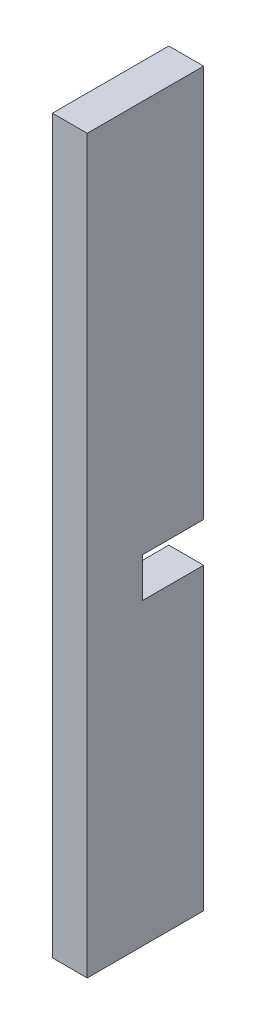
ISO-10303-21;
HEADER;
FILE_DESCRIPTION(('STEP AP214'),'2;1');
FILE_NAME('part.step','',(''),(''),'','','');
FILE_SCHEMA(('AUTOMOTIVE_DESIGN { 1 0 10303 214 1 1 1 1 }'));
ENDSEC;
DATA;
#1=APPLICATION_CONTEXT('core data for automotive mechanical design processes');
#2=APPLICATION_PROTOCOL_DEFINITION('international standard','automotive_design',2000,#1);
#3=PRODUCT_CONTEXT('',#1,'mechanical');
#4=PRODUCT('Part','Part','',(#3));
#5=PRODUCT_RELATED_PRODUCT_CATEGORY('part','',(#4));
#6=PRODUCT_DEFINITION_FORMATION('','',#4);
#7=PRODUCT_DEFINITION_CONTEXT('part definition',#1,'design');
#8=PRODUCT_DEFINITION('design','',#6,#7);
#9=PRODUCT_DEFINITION_SHAPE('','',#8);
#10=(LENGTH_UNIT() NAMED_UNIT(*) SI_UNIT(.MILLI.,.METRE.));
#11=(NAMED_UNIT(*) PLANE_ANGLE_UNIT() SI_UNIT($,.RADIAN.));
#12=(NAMED_UNIT(*) SI_UNIT($,.STERADIAN.) SOLID_ANGLE_UNIT());
#13=UNCERTAINTY_MEASURE_WITH_UNIT(LENGTH_MEASURE(1.E-05),#10,'distance_accuracy_value','');
#14=(GEOMETRIC_REPRESENTATION_CONTEXT(3) GLOBAL_UNCERTAINTY_ASSIGNED_CONTEXT((#13)) GLOBAL_UNIT_ASSIGNED_CONTEXT((#10,
#11,#12)) REPRESENTATION_CONTEXT('',''));
#15=CARTESIAN_POINT('',(0.,0.,0.));
#16=DIRECTION('',(0.,0.,1.));
#17=DIRECTION('',(1.,0.,0.));
#18=AXIS2_PLACEMENT_3D('',#15,#16,#17);
#19=CARTESIAN_POINT('',(0.,0.,0.));
#20=DIRECTION('',(0.,0.,-1.));
#21=DIRECTION('',(-1.,0.,0.));
#22=AXIS2_PLACEMENT_3D('',#19,#20,#21);
#23=PLANE('',#22);
#24=DIRECTION('',(1.,0.,0.));
#25=VECTOR('',#24,1.);
#26=CARTESIAN_POINT('',(0.,-17.0000000000002,0.));
#27=LINE('',#26,#25);
#28=CARTESIAN_POINT('',(-11.,-17.0000000000002,0.));
#29=VERTEX_POINT('',#28);
#30=CARTESIAN_POINT('',(11.,-17.0000000000002,0.));
#31=VERTEX_POINT('',#30);
#32=EDGE_CURVE('E11',#29,#31,#27,.T.);
#33=ORIENTED_EDGE('',*,*,#32,.F.);
#34=DIRECTION('',(0.,-1.,0.));
#35=VECTOR('',#34,1.);
#36=CARTESIAN_POINT('',(-11.,231.,0.));
#37=LINE('',#36,#35);
#38=CARTESIAN_POINT('',(-11.,231.,0.));
#39=VERTEX_POINT('',#38);
#40=EDGE_CURVE('E135',#39,#29,#37,.T.);
#41=ORIENTED_EDGE('',*,*,#40,.F.);
#42=DIRECTION('',(-1.,0.,0.));
#43=VECTOR('',#42,1.);
#44=CARTESIAN_POINT('',(11.,231.,0.));
#45=LINE('',#44,#43);
#46=CARTESIAN_POINT('',(11.,231.,0.));
#47=VERTEX_POINT('',#46);
#48=EDGE_CURVE('E136',#47,#39,#45,.T.);
#49=ORIENTED_EDGE('',*,*,#48,.F.);
#50=DIRECTION('',(0.,1.,0.));
#51=VECTOR('',#50,1.);
#52=CARTESIAN_POINT('',(11.,231.,0.));
#53=LINE('',#52,#51);
#54=EDGE_CURVE('E166',#31,#47,#53,.T.);
#55=ORIENTED_EDGE('',*,*,#54,.F.);
#56=EDGE_LOOP('',(#33,#41,#49,#55));
#57=FACE_BOUND('',#56,.T.);
#58=ADVANCED_FACE('F39',(#57),#23,.T.);
#59=CARTESIAN_POINT('',(11.,231.,73.5));
#60=DIRECTION('',(-1.,0.,0.));
#61=DIRECTION('',(0.,0.,1.));
#62=AXIS2_PLACEMENT_3D('',#59,#60,#61);
#63=PLANE('',#62);
#64=DIRECTION('',(0.,1.,0.));
#65=VECTOR('',#64,1.);
#66=CARTESIAN_POINT('',(11.,231.,38.5));
#67=LINE('',#66,#65);
#68=CARTESIAN_POINT('',(11.,-42.0000000000003,38.5));
#69=VERTEX_POINT('',#68);
#70=CARTESIAN_POINT('',(11.,-17.0000000000002,38.5));
#71=VERTEX_POINT('',#70);
#72=EDGE_CURVE('E171',#69,#71,#67,.T.);
#73=ORIENTED_EDGE('',*,*,#72,.T.);
#74=DIRECTION('',(0.,0.,-1.));
#75=VECTOR('',#74,1.);
#76=CARTESIAN_POINT('',(11.,-17.0000000000002,73.5));
#77=LINE('',#76,#75);
#78=EDGE_CURVE('E167',#71,#31,#77,.T.);
#79=ORIENTED_EDGE('',*,*,#78,.T.);
#80=ORIENTED_EDGE('',*,*,#54,.T.);
#81=DIRECTION('',(0.,0.,-1.));
#82=VECTOR('',#81,1.);
#83=CARTESIAN_POINT('',(11.,231.,73.5));
#84=LINE('',#83,#82);
#85=CARTESIAN_POINT('',(11.,231.,73.5));
#86=VERTEX_POINT('',#85);
#87=EDGE_CURVE('E122',#86,#47,#84,.T.);
#88=ORIENTED_EDGE('',*,*,#87,.F.);
#89=DIRECTION('',(0.,1.,0.));
#90=VECTOR('',#89,1.);
#91=CARTESIAN_POINT('',(11.,231.,73.5));
#92=LINE('',#91,#90);
#93=CARTESIAN_POINT('',(11.,-231.,73.5));
#94=VERTEX_POINT('',#93);
#95=EDGE_CURVE('E146',#94,#86,#92,.T.);
#96=ORIENTED_EDGE('',*,*,#95,.F.);
#97=DIRECTION('',(0.,0.,-1.));
#98=VECTOR('',#97,1.);
#99=CARTESIAN_POINT('',(11.,-231.,73.5));
#100=LINE('',#99,#98);
#101=CARTESIAN_POINT('',(11.,-231.,0.));
#102=VERTEX_POINT('',#101);
#103=EDGE_CURVE('E147',#94,#102,#100,.T.);
#104=ORIENTED_EDGE('',*,*,#103,.T.);
#105=CARTESIAN_POINT('',(11.,-42.0000000000001,0.));
#106=VERTEX_POINT('',#105);
#107=EDGE_CURVE('E140',#102,#106,#53,.T.);
#108=ORIENTED_EDGE('',*,*,#107,.T.);
#109=DIRECTION('',(0.,0.,1.));
#110=VECTOR('',#109,1.);
#111=CARTESIAN_POINT('',(11.,-42.0000000000003,73.5000000000001));
#112=LINE('',#111,#110);
#113=EDGE_CURVE('E55',#106,#69,#112,.T.);
#114=ORIENTED_EDGE('',*,*,#113,.T.);
#115=EDGE_LOOP('',(#73,#79,#80,#88,#96,#104,#108,#114));
#116=FACE_BOUND('',#115,.T.);
#117=ADVANCED_FACE('F41',(#116),#63,.F.);
#118=CARTESIAN_POINT('',(11.,231.,73.5));
#119=DIRECTION('',(0.,-1.,0.));
#120=DIRECTION('',(0.,0.,-1.));
#121=AXIS2_PLACEMENT_3D('',#118,#119,#120);
#122=PLANE('',#121);
#123=ORIENTED_EDGE('',*,*,#48,.T.);
#124=DIRECTION('',(0.,0.,-1.));
#125=VECTOR('',#124,1.);
#126=CARTESIAN_POINT('',(-11.,231.,73.5));
#127=LINE('',#126,#125);
#128=CARTESIAN_POINT('',(-11.,231.,73.5));
#129=VERTEX_POINT('',#128);
#130=EDGE_CURVE('E153',#129,#39,#127,.T.);
#131=ORIENTED_EDGE('',*,*,#130,.F.);
#132=DIRECTION('',(-1.,0.,0.));
#133=VECTOR('',#132,1.);
#134=CARTESIAN_POINT('',(11.,231.,73.5));
#135=LINE('',#134,#133);
#136=EDGE_CURVE('E93',#86,#129,#135,.T.);
#137=ORIENTED_EDGE('',*,*,#136,.F.);
#138=ORIENTED_EDGE('',*,*,#87,.T.);
#139=EDGE_LOOP('',(#123,#131,#137,#138));
#140=FACE_BOUND('',#139,.T.);
#141=ADVANCED_FACE('F159',(#140),#122,.F.);
#142=CARTESIAN_POINT('',(-11.,231.,73.5));
#143=DIRECTION('',(1.,0.,0.));
#144=DIRECTION('',(0.,0.,-1.));
#145=AXIS2_PLACEMENT_3D('',#142,#143,#144);
#146=PLANE('',#145);
#147=ORIENTED_EDGE('',*,*,#40,.T.);
#148=DIRECTION('',(0.,0.,-1.));
#149=VECTOR('',#148,1.);
#150=CARTESIAN_POINT('',(-11.,-17.0000000000002,0.));
#151=LINE('',#150,#149);
#152=CARTESIAN_POINT('',(-11.,-17.0000000000002,38.5));
#153=VERTEX_POINT('',#152);
#154=EDGE_CURVE('E173',#153,#29,#151,.T.);
#155=ORIENTED_EDGE('',*,*,#154,.F.);
#156=DIRECTION('',(0.,1.,0.));
#157=VECTOR('',#156,1.);
#158=CARTESIAN_POINT('',(-11.,-17.0000000000002,38.5));
#159=LINE('',#158,#157);
#160=CARTESIAN_POINT('',(-11.,-42.0000000000003,38.5));
#161=VERTEX_POINT('',#160);
#162=EDGE_CURVE('E130',#161,#153,#159,.T.);
#163=ORIENTED_EDGE('',*,*,#162,.F.);
#164=DIRECTION('',(0.,0.,1.));
#165=VECTOR('',#164,1.);
#166=CARTESIAN_POINT('',(-11.,-42.0000000000003,38.5));
#167=LINE('',#166,#165);
#168=CARTESIAN_POINT('',(-11.,-42.0000000000003,0.));
#169=VERTEX_POINT('',#168);
#170=EDGE_CURVE('E115',#169,#161,#167,.T.);
#171=ORIENTED_EDGE('',*,*,#170,.F.);
#172=CARTESIAN_POINT('',(-11.,-231.,0.));
#173=VERTEX_POINT('',#172);
#174=EDGE_CURVE('E127',#169,#173,#37,.T.);
#175=ORIENTED_EDGE('',*,*,#174,.T.);
#176=DIRECTION('',(0.,0.,-1.));
#177=VECTOR('',#176,1.);
#178=CARTESIAN_POINT('',(-11.,-231.,73.5));
#179=LINE('',#178,#177);
#180=CARTESIAN_POINT('',(-11.,-231.,73.5));
#181=VERTEX_POINT('',#180);
#182=EDGE_CURVE('E150',#181,#173,#179,.T.);
#183=ORIENTED_EDGE('',*,*,#182,.F.);
#184=DIRECTION('',(0.,-1.,0.));
#185=VECTOR('',#184,1.);
#186=CARTESIAN_POINT('',(-11.,231.,73.5));
#187=LINE('',#186,#185);
#188=EDGE_CURVE('E175',#129,#181,#187,.T.);
#189=ORIENTED_EDGE('',*,*,#188,.F.);
#190=ORIENTED_EDGE('',*,*,#130,.T.);
#191=EDGE_LOOP('',(#147,#155,#163,#171,#175,#183,#189,#190));
#192=FACE_BOUND('',#191,.T.);
#193=ADVANCED_FACE('F125',(#192),#146,.F.);
#194=CARTESIAN_POINT('',(11.,-231.,73.5));
#195=DIRECTION('',(0.,1.,0.));
#196=DIRECTION('',(0.,0.,1.));
#197=AXIS2_PLACEMENT_3D('',#194,#195,#196);
#198=PLANE('',#197);
#199=DIRECTION('',(1.,0.,0.));
#200=VECTOR('',#199,1.);
#201=CARTESIAN_POINT('',(11.,-231.,0.));
#202=LINE('',#201,#200);
#203=EDGE_CURVE('E85',#173,#102,#202,.T.);
#204=ORIENTED_EDGE('',*,*,#203,.T.);
#205=ORIENTED_EDGE('',*,*,#103,.F.);
#206=DIRECTION('',(1.,0.,0.));
#207=VECTOR('',#206,1.);
#208=CARTESIAN_POINT('',(11.,-231.,73.5));
#209=LINE('',#208,#207);
#210=EDGE_CURVE('E64',#181,#94,#209,.T.);
#211=ORIENTED_EDGE('',*,*,#210,.F.);
#212=ORIENTED_EDGE('',*,*,#182,.T.);
#213=EDGE_LOOP('',(#204,#205,#211,#212));
#214=FACE_BOUND('',#213,.T.);
#215=ADVANCED_FACE('F184',(#214),#198,.F.);
#216=CARTESIAN_POINT('',(0.,0.,73.5));
#217=DIRECTION('',(0.,0.,-1.));
#218=DIRECTION('',(-1.,0.,0.));
#219=AXIS2_PLACEMENT_3D('',#216,#217,#218);
#220=PLANE('',#219);
#221=ORIENTED_EDGE('',*,*,#95,.T.);
#222=ORIENTED_EDGE('',*,*,#136,.T.);
#223=ORIENTED_EDGE('',*,*,#188,.T.);
#224=ORIENTED_EDGE('',*,*,#210,.T.);
#225=EDGE_LOOP('',(#221,#222,#223,#224));
#226=FACE_BOUND('',#225,.T.);
#227=ADVANCED_FACE('F186',(#226),#220,.F.);
#228=DIRECTION('',(-1.,0.,0.));
#229=VECTOR('',#228,1.);
#230=CARTESIAN_POINT('',(0.,-42.0000000000003,0.));
#231=LINE('',#230,#229);
#232=EDGE_CURVE('E48',#106,#169,#231,.T.);
#233=ORIENTED_EDGE('',*,*,#232,.F.);
#234=ORIENTED_EDGE('',*,*,#107,.F.);
#235=ORIENTED_EDGE('',*,*,#203,.F.);
#236=ORIENTED_EDGE('',*,*,#174,.F.);
#237=EDGE_LOOP('',(#233,#234,#235,#236));
#238=FACE_BOUND('',#237,.T.);
#239=ADVANCED_FACE('F133',(#238),#23,.T.);
#240=CARTESIAN_POINT('',(24.,-17.0000000000002,38.5));
#241=DIRECTION('',(0.,0.,1.));
#242=DIRECTION('',(1.,0.,0.));
#243=AXIS2_PLACEMENT_3D('',#240,#241,#242);
#244=PLANE('',#243);
#245=DIRECTION('',(-1.,0.,0.));
#246=VECTOR('',#245,1.);
#247=CARTESIAN_POINT('',(24.,-42.0000000000003,38.5));
#248=LINE('',#247,#246);
#249=EDGE_CURVE('E267',#69,#161,#248,.T.);
#250=ORIENTED_EDGE('',*,*,#249,.T.);
#251=ORIENTED_EDGE('',*,*,#162,.T.);
#252=DIRECTION('',(-1.,0.,0.));
#253=VECTOR('',#252,1.);
#254=CARTESIAN_POINT('',(24.,-17.0000000000002,38.5));
#255=LINE('',#254,#253);
#256=EDGE_CURVE('E270',#71,#153,#255,.T.);
#257=ORIENTED_EDGE('',*,*,#256,.F.);
#258=ORIENTED_EDGE('',*,*,#72,.F.);
#259=EDGE_LOOP('',(#250,#251,#257,#258));
#260=FACE_BOUND('',#259,.T.);
#261=ADVANCED_FACE('F200',(#260),#244,.F.);
#262=CARTESIAN_POINT('',(24.,-17.0000000000002,0.));
#263=DIRECTION('',(0.,1.,0.));
#264=DIRECTION('',(-1.,0.,0.));
#265=AXIS2_PLACEMENT_3D('',#262,#263,#264);
#266=PLANE('',#265);
#267=ORIENTED_EDGE('',*,*,#256,.T.);
#268=ORIENTED_EDGE('',*,*,#154,.T.);
#269=ORIENTED_EDGE('',*,*,#32,.T.);
#270=ORIENTED_EDGE('',*,*,#78,.F.);
#271=EDGE_LOOP('',(#267,#268,#269,#270));
#272=FACE_BOUND('',#271,.T.);
#273=ADVANCED_FACE('F204',(#272),#266,.F.);
#274=CARTESIAN_POINT('',(24.,-42.0000000000003,38.5));
#275=DIRECTION('',(0.,-1.,0.));
#276=DIRECTION('',(0.,0.,-1.));
#277=AXIS2_PLACEMENT_3D('',#274,#275,#276);
#278=PLANE('',#277);
#279=ORIENTED_EDGE('',*,*,#232,.T.);
#280=ORIENTED_EDGE('',*,*,#170,.T.);
#281=ORIENTED_EDGE('',*,*,#249,.F.);
#282=ORIENTED_EDGE('',*,*,#113,.F.);
#283=EDGE_LOOP('',(#279,#280,#281,#282));
#284=FACE_BOUND('',#283,.T.);
#285=ADVANCED_FACE('F114',(#284),#278,.F.);
#286=CLOSED_SHELL('',(#58,#117,#141,#193,#215,#227,#239,#261,#273,#285));
#287=MANIFOLD_SOLID_BREP('B2',#286);
#288=ADVANCED_BREP_SHAPE_REPRESENTATION('',(#18,#287),#14);
#289=SHAPE_DEFINITION_REPRESENTATION(#9,#288);
ENDSEC;
END-ISO-10303-21;
